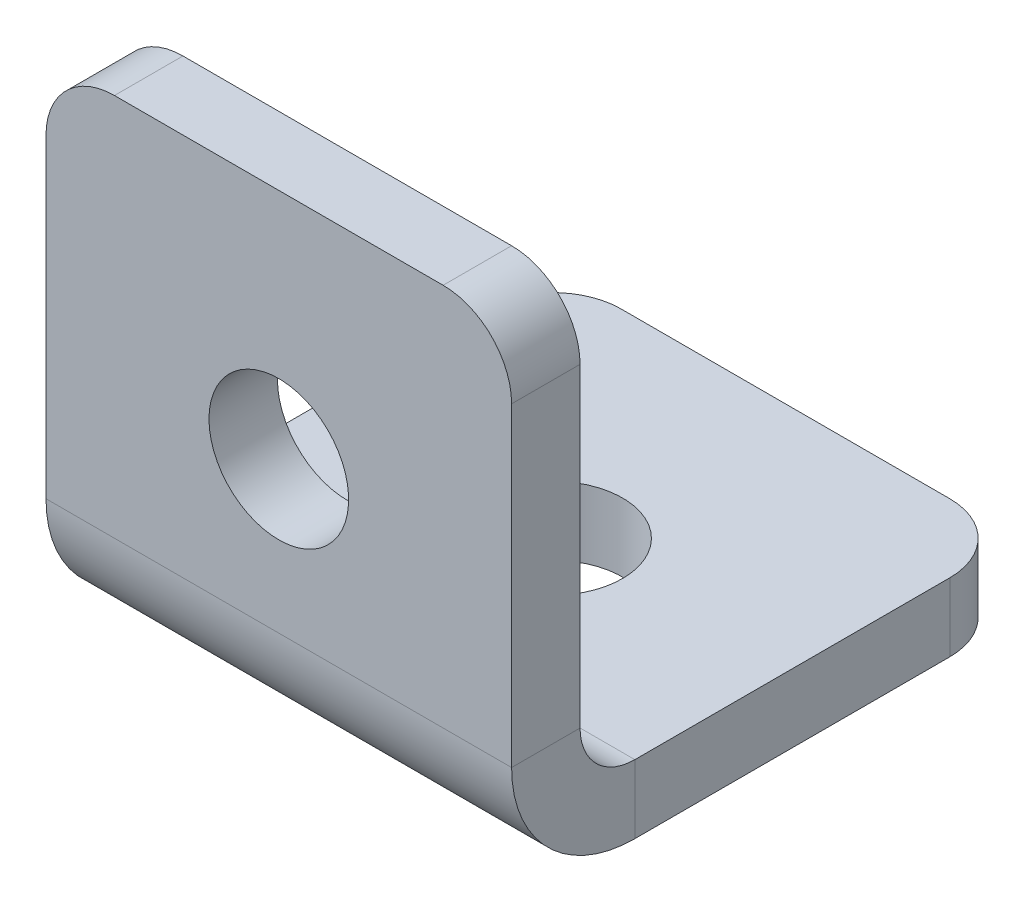
ISO-10303-21;
HEADER;
FILE_DESCRIPTION(('STEP AP214'),'2;1');
FILE_NAME('part.step','',(''),(''),'','','');
FILE_SCHEMA(('AUTOMOTIVE_DESIGN { 1 0 10303 214 1 1 1 1 }'));
ENDSEC;
DATA;
#1=APPLICATION_CONTEXT('core data for automotive mechanical design processes');
#2=APPLICATION_PROTOCOL_DEFINITION('international standard','automotive_design',2000,#1);
#3=PRODUCT_CONTEXT('',#1,'mechanical');
#4=PRODUCT('Part','Part','',(#3));
#5=PRODUCT_RELATED_PRODUCT_CATEGORY('part','',(#4));
#6=PRODUCT_DEFINITION_FORMATION('','',#4);
#7=PRODUCT_DEFINITION_CONTEXT('part definition',#1,'design');
#8=PRODUCT_DEFINITION('design','',#6,#7);
#9=PRODUCT_DEFINITION_SHAPE('','',#8);
#10=(LENGTH_UNIT() NAMED_UNIT(*) SI_UNIT(.MILLI.,.METRE.));
#11=(NAMED_UNIT(*) PLANE_ANGLE_UNIT() SI_UNIT($,.RADIAN.));
#12=(NAMED_UNIT(*) SI_UNIT($,.STERADIAN.) SOLID_ANGLE_UNIT());
#13=UNCERTAINTY_MEASURE_WITH_UNIT(LENGTH_MEASURE(1.E-05),#10,'distance_accuracy_value','');
#14=(GEOMETRIC_REPRESENTATION_CONTEXT(3) GLOBAL_UNCERTAINTY_ASSIGNED_CONTEXT((#13)) GLOBAL_UNIT_ASSIGNED_CONTEXT((#10,
#11,#12)) REPRESENTATION_CONTEXT('',''));
#15=CARTESIAN_POINT('',(0.,0.,0.));
#16=DIRECTION('',(0.,0.,1.));
#17=DIRECTION('',(1.,0.,0.));
#18=AXIS2_PLACEMENT_3D('',#15,#16,#17);
#19=CARTESIAN_POINT('',(17.,4.5,0.));
#20=DIRECTION('',(1.,0.,0.));
#21=DIRECTION('',(0.,0.,-1.));
#22=AXIS2_PLACEMENT_3D('',#19,#20,#21);
#23=PLANE('',#22);
#24=DIRECTION('',(0.,0.,-1.));
#25=VECTOR('',#24,1.);
#26=CARTESIAN_POINT('',(17.,4.5,0.));
#27=LINE('',#26,#25);
#28=CARTESIAN_POINT('',(17.,4.5,0.));
#29=VERTEX_POINT('',#28);
#30=CARTESIAN_POINT('',(17.,4.5,-2.5));
#31=VERTEX_POINT('',#30);
#32=EDGE_CURVE('E115',#29,#31,#27,.T.);
#33=ORIENTED_EDGE('',*,*,#32,.F.);
#34=CARTESIAN_POINT('',(17.,4.5,-4.5));
#35=DIRECTION('',(-1.,0.,0.));
#36=DIRECTION('',(0.,0.,1.));
#37=AXIS2_PLACEMENT_3D('',#34,#35,#36);
#38=CIRCLE('',#37,4.5);
#39=CARTESIAN_POINT('',(17.,0.,-4.5));
#40=VERTEX_POINT('',#39);
#41=EDGE_CURVE('E113',#29,#40,#38,.F.);
#42=ORIENTED_EDGE('',*,*,#41,.T.);
#43=DIRECTION('',(0.,-1.,0.));
#44=VECTOR('',#43,1.);
#45=CARTESIAN_POINT('',(17.,2.5,-4.5));
#46=LINE('',#45,#44);
#47=CARTESIAN_POINT('',(17.,2.5,-4.5));
#48=VERTEX_POINT('',#47);
#49=EDGE_CURVE('E107',#48,#40,#46,.T.);
#50=ORIENTED_EDGE('',*,*,#49,.F.);
#51=CARTESIAN_POINT('',(17.,4.5,-4.5));
#52=DIRECTION('',(1.,0.,0.));
#53=DIRECTION('',(0.,0.,-1.));
#54=AXIS2_PLACEMENT_3D('',#51,#52,#53);
#55=CIRCLE('',#54,2.);
#56=EDGE_CURVE('E111',#31,#48,#55,.T.);
#57=ORIENTED_EDGE('',*,*,#56,.F.);
#58=EDGE_LOOP('',(#33,#42,#50,#57));
#59=FACE_BOUND('',#58,.T.);
#60=ADVANCED_FACE('F16',(#59),#23,.T.);
#61=CARTESIAN_POINT('',(17.,2.5,-4.5));
#62=DIRECTION('',(1.,0.,0.));
#63=DIRECTION('',(0.,0.,-1.));
#64=AXIS2_PLACEMENT_3D('',#61,#62,#63);
#65=PLANE('',#64);
#66=DIRECTION('',(0.,1.,0.));
#67=VECTOR('',#66,1.);
#68=CARTESIAN_POINT('',(17.,0.,-2.5));
#69=LINE('',#68,#67);
#70=CARTESIAN_POINT('',(17.,16.,-2.5));
#71=VERTEX_POINT('',#70);
#72=EDGE_CURVE('E139',#71,#31,#69,.F.);
#73=ORIENTED_EDGE('',*,*,#72,.F.);
#74=DIRECTION('',(0.,0.,-1.));
#75=VECTOR('',#74,1.);
#76=CARTESIAN_POINT('',(17.,16.,-4.5));
#77=LINE('',#76,#75);
#78=CARTESIAN_POINT('',(17.,16.,0.));
#79=VERTEX_POINT('',#78);
#80=EDGE_CURVE('E192',#71,#79,#77,.F.);
#81=ORIENTED_EDGE('',*,*,#80,.T.);
#82=DIRECTION('',(0.,-1.,0.));
#83=VECTOR('',#82,1.);
#84=CARTESIAN_POINT('',(17.,0.,0.));
#85=LINE('',#84,#83);
#86=EDGE_CURVE('E141',#79,#29,#85,.T.);
#87=ORIENTED_EDGE('',*,*,#86,.T.);
#88=ORIENTED_EDGE('',*,*,#32,.T.);
#89=EDGE_LOOP('',(#73,#81,#87,#88));
#90=FACE_BOUND('',#89,.T.);
#91=ADVANCED_FACE('F260',(#90),#65,.T.);
#92=CARTESIAN_POINT('',(0.,0.,-4.5));
#93=DIRECTION('',(-1.,0.,0.));
#94=DIRECTION('',(0.,0.,1.));
#95=AXIS2_PLACEMENT_3D('',#92,#93,#94);
#96=PLANE('',#95);
#97=DIRECTION('',(0.,1.,0.));
#98=VECTOR('',#97,1.);
#99=CARTESIAN_POINT('',(0.,0.,-4.5));
#100=LINE('',#99,#98);
#101=CARTESIAN_POINT('',(0.,0.,-4.5));
#102=VERTEX_POINT('',#101);
#103=CARTESIAN_POINT('',(0.,2.5,-4.5));
#104=VERTEX_POINT('',#103);
#105=EDGE_CURVE('E116',#102,#104,#100,.T.);
#106=ORIENTED_EDGE('',*,*,#105,.F.);
#107=CARTESIAN_POINT('',(0.,4.5,-4.5));
#108=DIRECTION('',(-1.,0.,0.));
#109=DIRECTION('',(0.,0.,1.));
#110=AXIS2_PLACEMENT_3D('',#107,#108,#109);
#111=CIRCLE('',#110,4.5);
#112=CARTESIAN_POINT('',(0.,4.5,0.));
#113=VERTEX_POINT('',#112);
#114=EDGE_CURVE('E159',#113,#102,#111,.F.);
#115=ORIENTED_EDGE('',*,*,#114,.F.);
#116=DIRECTION('',(0.,0.,1.));
#117=VECTOR('',#116,1.);
#118=CARTESIAN_POINT('',(0.,4.5,-2.5));
#119=LINE('',#118,#117);
#120=CARTESIAN_POINT('',(0.,4.5,-2.5));
#121=VERTEX_POINT('',#120);
#122=EDGE_CURVE('E177',#121,#113,#119,.T.);
#123=ORIENTED_EDGE('',*,*,#122,.F.);
#124=CARTESIAN_POINT('',(0.,4.5,-4.5));
#125=DIRECTION('',(1.,0.,0.));
#126=DIRECTION('',(0.,0.,-1.));
#127=AXIS2_PLACEMENT_3D('',#124,#125,#126);
#128=CIRCLE('',#127,2.);
#129=EDGE_CURVE('E153',#121,#104,#128,.T.);
#130=ORIENTED_EDGE('',*,*,#129,.T.);
#131=EDGE_LOOP('',(#106,#115,#123,#130));
#132=FACE_BOUND('',#131,.T.);
#133=ADVANCED_FACE('F265',(#132),#96,.T.);
#134=CARTESIAN_POINT('',(0.,4.5,-2.5));
#135=DIRECTION('',(-1.,0.,0.));
#136=DIRECTION('',(0.,0.,1.));
#137=AXIS2_PLACEMENT_3D('',#134,#135,#136);
#138=PLANE('',#137);
#139=DIRECTION('',(0.,0.,-1.));
#140=VECTOR('',#139,1.);
#141=CARTESIAN_POINT('',(0.,2.5,0.));
#142=LINE('',#141,#140);
#143=CARTESIAN_POINT('',(0.,2.5,-16.));
#144=VERTEX_POINT('',#143);
#145=EDGE_CURVE('E126',#104,#144,#142,.T.);
#146=ORIENTED_EDGE('',*,*,#145,.T.);
#147=DIRECTION('',(0.,-1.,0.));
#148=VECTOR('',#147,1.);
#149=CARTESIAN_POINT('',(0.,4.5,-16.));
#150=LINE('',#149,#148);
#151=CARTESIAN_POINT('',(0.,0.,-16.));
#152=VERTEX_POINT('',#151);
#153=EDGE_CURVE('E201',#144,#152,#150,.T.);
#154=ORIENTED_EDGE('',*,*,#153,.T.);
#155=DIRECTION('',(0.,0.,-1.));
#156=VECTOR('',#155,1.);
#157=CARTESIAN_POINT('',(0.,0.,0.));
#158=LINE('',#157,#156);
#159=EDGE_CURVE('E148',#102,#152,#158,.T.);
#160=ORIENTED_EDGE('',*,*,#159,.F.);
#161=ORIENTED_EDGE('',*,*,#105,.T.);
#162=EDGE_LOOP('',(#146,#154,#160,#161));
#163=FACE_BOUND('',#162,.T.);
#164=ADVANCED_FACE('F217',(#163),#138,.T.);
#165=CARTESIAN_POINT('',(17.,0.,0.));
#166=DIRECTION('',(0.,1.,0.));
#167=DIRECTION('',(0.,0.,1.));
#168=AXIS2_PLACEMENT_3D('',#165,#166,#167);
#169=PLANE('',#168);
#170=CARTESIAN_POINT('',(8.5,0.,-10.));
#171=DIRECTION('',(0.,1.,0.));
#172=DIRECTION('',(0.,0.,1.));
#173=AXIS2_PLACEMENT_3D('',#170,#171,#172);
#174=CIRCLE('',#173,2.55);
#175=CARTESIAN_POINT('',(8.5,0.,-7.45));
#176=VERTEX_POINT('',#175);
#177=EDGE_CURVE('E231',#176,#176,#174,.T.);
#178=ORIENTED_EDGE('',*,*,#177,.T.);
#179=EDGE_LOOP('',(#178));
#180=FACE_BOUND('',#179,.T.);
#181=ORIENTED_EDGE('',*,*,#159,.T.);
#182=CARTESIAN_POINT('',(2.5,0.,-16.));
#183=DIRECTION('',(0.,1.,0.));
#184=DIRECTION('',(0.,0.,1.));
#185=AXIS2_PLACEMENT_3D('',#182,#183,#184);
#186=CIRCLE('',#185,2.5);
#187=CARTESIAN_POINT('',(2.5,0.,-18.5));
#188=VERTEX_POINT('',#187);
#189=EDGE_CURVE('E206',#152,#188,#186,.F.);
#190=ORIENTED_EDGE('',*,*,#189,.T.);
#191=DIRECTION('',(-1.,0.,0.));
#192=VECTOR('',#191,1.);
#193=CARTESIAN_POINT('',(17.,0.,-18.5));
#194=LINE('',#193,#192);
#195=CARTESIAN_POINT('',(14.5,0.,-18.5));
#196=VERTEX_POINT('',#195);
#197=EDGE_CURVE('E175',#196,#188,#194,.T.);
#198=ORIENTED_EDGE('',*,*,#197,.F.);
#199=CARTESIAN_POINT('',(14.5,0.,-16.));
#200=DIRECTION('',(0.,1.,0.));
#201=DIRECTION('',(0.,0.,1.));
#202=AXIS2_PLACEMENT_3D('',#199,#200,#201);
#203=CIRCLE('',#202,2.5);
#204=CARTESIAN_POINT('',(17.,0.,-16.));
#205=VERTEX_POINT('',#204);
#206=EDGE_CURVE('E204',#196,#205,#203,.F.);
#207=ORIENTED_EDGE('',*,*,#206,.T.);
#208=DIRECTION('',(0.,0.,-1.));
#209=VECTOR('',#208,1.);
#210=CARTESIAN_POINT('',(17.,0.,0.));
#211=LINE('',#210,#209);
#212=EDGE_CURVE('E134',#40,#205,#211,.T.);
#213=ORIENTED_EDGE('',*,*,#212,.F.);
#214=DIRECTION('',(-1.,0.,0.));
#215=VECTOR('',#214,1.);
#216=CARTESIAN_POINT('',(17.,0.,-4.5));
#217=LINE('',#216,#215);
#218=EDGE_CURVE('E147',#40,#102,#217,.T.);
#219=ORIENTED_EDGE('',*,*,#218,.T.);
#220=EDGE_LOOP('',(#181,#190,#198,#207,#213,#219));
#221=FACE_BOUND('',#220,.T.);
#222=ADVANCED_FACE('F222',(#180,#221),#169,.F.);
#223=CARTESIAN_POINT('',(17.,2.5,-18.5));
#224=DIRECTION('',(0.,0.,-1.));
#225=DIRECTION('',(-1.,0.,0.));
#226=AXIS2_PLACEMENT_3D('',#223,#224,#225);
#227=PLANE('',#226);
#228=ORIENTED_EDGE('',*,*,#197,.T.);
#229=DIRECTION('',(0.,-1.,0.));
#230=VECTOR('',#229,1.);
#231=CARTESIAN_POINT('',(2.5,2.5,-18.5));
#232=LINE('',#231,#230);
#233=CARTESIAN_POINT('',(2.5,2.5,-18.5));
#234=VERTEX_POINT('',#233);
#235=EDGE_CURVE('E37',#188,#234,#232,.F.);
#236=ORIENTED_EDGE('',*,*,#235,.T.);
#237=DIRECTION('',(-1.,0.,0.));
#238=VECTOR('',#237,1.);
#239=CARTESIAN_POINT('',(17.,2.5,-18.5));
#240=LINE('',#239,#238);
#241=CARTESIAN_POINT('',(14.5,2.5,-18.5));
#242=VERTEX_POINT('',#241);
#243=EDGE_CURVE('E130',#242,#234,#240,.T.);
#244=ORIENTED_EDGE('',*,*,#243,.F.);
#245=DIRECTION('',(0.,-1.,0.));
#246=VECTOR('',#245,1.);
#247=CARTESIAN_POINT('',(14.5,2.5,-18.5));
#248=LINE('',#247,#246);
#249=EDGE_CURVE('E208',#242,#196,#248,.T.);
#250=ORIENTED_EDGE('',*,*,#249,.T.);
#251=EDGE_LOOP('',(#228,#236,#244,#250));
#252=FACE_BOUND('',#251,.T.);
#253=ADVANCED_FACE('F223',(#252),#227,.T.);
#254=CARTESIAN_POINT('',(17.,2.5,0.));
#255=DIRECTION('',(0.,1.,0.));
#256=DIRECTION('',(0.,0.,1.));
#257=AXIS2_PLACEMENT_3D('',#254,#255,#256);
#258=PLANE('',#257);
#259=CARTESIAN_POINT('',(8.5,2.5,-10.));
#260=DIRECTION('',(0.,1.,0.));
#261=DIRECTION('',(0.,0.,1.));
#262=AXIS2_PLACEMENT_3D('',#259,#260,#261);
#263=CIRCLE('',#262,2.55);
#264=CARTESIAN_POINT('',(8.5,2.5,-7.45));
#265=VERTEX_POINT('',#264);
#266=EDGE_CURVE('E234',#265,#265,#263,.T.);
#267=ORIENTED_EDGE('',*,*,#266,.F.);
#268=EDGE_LOOP('',(#267));
#269=FACE_BOUND('',#268,.T.);
#270=ORIENTED_EDGE('',*,*,#243,.T.);
#271=CARTESIAN_POINT('',(2.5,2.5,-16.));
#272=DIRECTION('',(0.,1.,0.));
#273=DIRECTION('',(0.,0.,1.));
#274=AXIS2_PLACEMENT_3D('',#271,#272,#273);
#275=CIRCLE('',#274,2.5);
#276=EDGE_CURVE('E24',#234,#144,#275,.T.);
#277=ORIENTED_EDGE('',*,*,#276,.T.);
#278=ORIENTED_EDGE('',*,*,#145,.F.);
#279=DIRECTION('',(-1.,0.,0.));
#280=VECTOR('',#279,1.);
#281=CARTESIAN_POINT('',(17.,2.5,-4.5));
#282=LINE('',#281,#280);
#283=EDGE_CURVE('E121',#48,#104,#282,.T.);
#284=ORIENTED_EDGE('',*,*,#283,.F.);
#285=DIRECTION('',(0.,0.,-1.));
#286=VECTOR('',#285,1.);
#287=CARTESIAN_POINT('',(17.,2.5,0.));
#288=LINE('',#287,#286);
#289=CARTESIAN_POINT('',(17.,2.5,-16.));
#290=VERTEX_POINT('',#289);
#291=EDGE_CURVE('E123',#48,#290,#288,.T.);
#292=ORIENTED_EDGE('',*,*,#291,.T.);
#293=CARTESIAN_POINT('',(14.5,2.5,-16.));
#294=DIRECTION('',(0.,1.,0.));
#295=DIRECTION('',(0.,0.,1.));
#296=AXIS2_PLACEMENT_3D('',#293,#294,#295);
#297=CIRCLE('',#296,2.5);
#298=EDGE_CURVE('E212',#290,#242,#297,.T.);
#299=ORIENTED_EDGE('',*,*,#298,.T.);
#300=EDGE_LOOP('',(#270,#277,#278,#284,#292,#299));
#301=FACE_BOUND('',#300,.T.);
#302=ADVANCED_FACE('F122',(#269,#301),#258,.T.);
#303=CARTESIAN_POINT('',(17.,4.5,-4.5));
#304=DIRECTION('',(-1.,0.,0.));
#305=DIRECTION('',(0.,0.,1.));
#306=AXIS2_PLACEMENT_3D('',#303,#304,#305);
#307=CYLINDRICAL_SURFACE('',#306,2.);
#308=ORIENTED_EDGE('',*,*,#129,.F.);
#309=DIRECTION('',(-1.,0.,0.));
#310=VECTOR('',#309,1.);
#311=CARTESIAN_POINT('',(17.,4.5,-2.5));
#312=LINE('',#311,#310);
#313=EDGE_CURVE('E131',#31,#121,#312,.T.);
#314=ORIENTED_EDGE('',*,*,#313,.F.);
#315=ORIENTED_EDGE('',*,*,#56,.T.);
#316=ORIENTED_EDGE('',*,*,#283,.T.);
#317=EDGE_LOOP('',(#308,#314,#315,#316));
#318=FACE_BOUND('',#317,.T.);
#319=ADVANCED_FACE('F137',(#318),#307,.F.);
#320=CARTESIAN_POINT('',(17.,0.,-2.5));
#321=DIRECTION('',(0.,0.,-1.));
#322=DIRECTION('',(-1.,0.,0.));
#323=AXIS2_PLACEMENT_3D('',#320,#321,#322);
#324=PLANE('',#323);
#325=CARTESIAN_POINT('',(8.5,10.,-2.5));
#326=DIRECTION('',(0.,0.,-1.));
#327=DIRECTION('',(-1.,0.,0.));
#328=AXIS2_PLACEMENT_3D('',#325,#326,#327);
#329=CIRCLE('',#328,2.55);
#330=CARTESIAN_POINT('',(5.95,10.,-2.5));
#331=VERTEX_POINT('',#330);
#332=EDGE_CURVE('E228',#331,#331,#329,.T.);
#333=ORIENTED_EDGE('',*,*,#332,.F.);
#334=EDGE_LOOP('',(#333));
#335=FACE_BOUND('',#334,.T.);
#336=DIRECTION('',(-1.,0.,0.));
#337=VECTOR('',#336,1.);
#338=CARTESIAN_POINT('',(17.,18.5,-2.5));
#339=LINE('',#338,#337);
#340=CARTESIAN_POINT('',(14.5,18.5,-2.5));
#341=VERTEX_POINT('',#340);
#342=CARTESIAN_POINT('',(2.5,18.5,-2.5));
#343=VERTEX_POINT('',#342);
#344=EDGE_CURVE('E170',#341,#343,#339,.T.);
#345=ORIENTED_EDGE('',*,*,#344,.F.);
#346=CARTESIAN_POINT('',(14.5,16.,-2.5));
#347=DIRECTION('',(0.,0.,-1.));
#348=DIRECTION('',(-1.,0.,0.));
#349=AXIS2_PLACEMENT_3D('',#346,#347,#348);
#350=CIRCLE('',#349,2.5);
#351=EDGE_CURVE('E190',#341,#71,#350,.T.);
#352=ORIENTED_EDGE('',*,*,#351,.T.);
#353=ORIENTED_EDGE('',*,*,#72,.T.);
#354=ORIENTED_EDGE('',*,*,#313,.T.);
#355=DIRECTION('',(0.,1.,0.));
#356=VECTOR('',#355,1.);
#357=CARTESIAN_POINT('',(0.,0.,-2.5));
#358=LINE('',#357,#356);
#359=CARTESIAN_POINT('',(0.,16.,-2.5));
#360=VERTEX_POINT('',#359);
#361=EDGE_CURVE('E155',#360,#121,#358,.F.);
#362=ORIENTED_EDGE('',*,*,#361,.F.);
#363=CARTESIAN_POINT('',(2.5,16.,-2.5));
#364=DIRECTION('',(0.,0.,-1.));
#365=DIRECTION('',(-1.,0.,0.));
#366=AXIS2_PLACEMENT_3D('',#363,#364,#365);
#367=CIRCLE('',#366,2.5);
#368=EDGE_CURVE('E188',#360,#343,#367,.T.);
#369=ORIENTED_EDGE('',*,*,#368,.T.);
#370=EDGE_LOOP('',(#345,#352,#353,#354,#362,#369));
#371=FACE_BOUND('',#370,.T.);
#372=ADVANCED_FACE('F256',(#335,#371),#324,.T.);
#373=CARTESIAN_POINT('',(17.,18.5,0.));
#374=DIRECTION('',(0.,1.,0.));
#375=DIRECTION('',(0.,0.,1.));
#376=AXIS2_PLACEMENT_3D('',#373,#374,#375);
#377=PLANE('',#376);
#378=DIRECTION('',(-1.,0.,0.));
#379=VECTOR('',#378,1.);
#380=CARTESIAN_POINT('',(17.,18.5,0.));
#381=LINE('',#380,#379);
#382=CARTESIAN_POINT('',(14.5,18.5,0.));
#383=VERTEX_POINT('',#382);
#384=CARTESIAN_POINT('',(2.5,18.5,0.));
#385=VERTEX_POINT('',#384);
#386=EDGE_CURVE('E167',#383,#385,#381,.T.);
#387=ORIENTED_EDGE('',*,*,#386,.F.);
#388=DIRECTION('',(0.,0.,-1.));
#389=VECTOR('',#388,1.);
#390=CARTESIAN_POINT('',(14.5,18.5,0.));
#391=LINE('',#390,#389);
#392=EDGE_CURVE('E185',#383,#341,#391,.T.);
#393=ORIENTED_EDGE('',*,*,#392,.T.);
#394=ORIENTED_EDGE('',*,*,#344,.T.);
#395=DIRECTION('',(0.,0.,-1.));
#396=VECTOR('',#395,1.);
#397=CARTESIAN_POINT('',(2.5,18.5,0.));
#398=LINE('',#397,#396);
#399=EDGE_CURVE('E183',#343,#385,#398,.F.);
#400=ORIENTED_EDGE('',*,*,#399,.T.);
#401=EDGE_LOOP('',(#387,#393,#394,#400));
#402=FACE_BOUND('',#401,.T.);
#403=ADVANCED_FACE('F359',(#402),#377,.T.);
#404=CARTESIAN_POINT('',(17.,0.,0.));
#405=DIRECTION('',(0.,0.,-1.));
#406=DIRECTION('',(-1.,0.,0.));
#407=AXIS2_PLACEMENT_3D('',#404,#405,#406);
#408=PLANE('',#407);
#409=CARTESIAN_POINT('',(8.5,10.,0.));
#410=DIRECTION('',(0.,0.,-1.));
#411=DIRECTION('',(-1.,0.,0.));
#412=AXIS2_PLACEMENT_3D('',#409,#410,#411);
#413=CIRCLE('',#412,2.55);
#414=CARTESIAN_POINT('',(5.95,10.,0.));
#415=VERTEX_POINT('',#414);
#416=EDGE_CURVE('E151',#415,#415,#413,.T.);
#417=ORIENTED_EDGE('',*,*,#416,.T.);
#418=EDGE_LOOP('',(#417));
#419=FACE_BOUND('',#418,.T.);
#420=ORIENTED_EDGE('',*,*,#86,.F.);
#421=CARTESIAN_POINT('',(14.5,16.,0.));
#422=DIRECTION('',(0.,0.,-1.));
#423=DIRECTION('',(-1.,0.,0.));
#424=AXIS2_PLACEMENT_3D('',#421,#422,#423);
#425=CIRCLE('',#424,2.5);
#426=EDGE_CURVE('E196',#79,#383,#425,.F.);
#427=ORIENTED_EDGE('',*,*,#426,.T.);
#428=ORIENTED_EDGE('',*,*,#386,.T.);
#429=CARTESIAN_POINT('',(2.5,16.,0.));
#430=DIRECTION('',(0.,0.,-1.));
#431=DIRECTION('',(-1.,0.,0.));
#432=AXIS2_PLACEMENT_3D('',#429,#430,#431);
#433=CIRCLE('',#432,2.5);
#434=CARTESIAN_POINT('',(0.,16.,0.));
#435=VERTEX_POINT('',#434);
#436=EDGE_CURVE('E194',#385,#435,#433,.F.);
#437=ORIENTED_EDGE('',*,*,#436,.T.);
#438=DIRECTION('',(0.,-1.,0.));
#439=VECTOR('',#438,1.);
#440=CARTESIAN_POINT('',(0.,0.,0.));
#441=LINE('',#440,#439);
#442=EDGE_CURVE('E157',#435,#113,#441,.T.);
#443=ORIENTED_EDGE('',*,*,#442,.T.);
#444=DIRECTION('',(-1.,0.,0.));
#445=VECTOR('',#444,1.);
#446=CARTESIAN_POINT('',(17.,4.5,0.));
#447=LINE('',#446,#445);
#448=EDGE_CURVE('E164',#29,#113,#447,.T.);
#449=ORIENTED_EDGE('',*,*,#448,.F.);
#450=EDGE_LOOP('',(#420,#427,#428,#437,#443,#449));
#451=FACE_BOUND('',#450,.T.);
#452=ADVANCED_FACE('F349',(#419,#451),#408,.F.);
#453=CARTESIAN_POINT('',(17.,4.5,-4.5));
#454=DIRECTION('',(-1.,0.,0.));
#455=DIRECTION('',(0.,0.,1.));
#456=AXIS2_PLACEMENT_3D('',#453,#454,#455);
#457=CYLINDRICAL_SURFACE('',#456,4.5);
#458=ORIENTED_EDGE('',*,*,#114,.T.);
#459=ORIENTED_EDGE('',*,*,#218,.F.);
#460=ORIENTED_EDGE('',*,*,#41,.F.);
#461=ORIENTED_EDGE('',*,*,#448,.T.);
#462=EDGE_LOOP('',(#458,#459,#460,#461));
#463=FACE_BOUND('',#462,.T.);
#464=ADVANCED_FACE('F340',(#463),#457,.T.);
#465=CARTESIAN_POINT('',(17.,4.5,-4.5));
#466=DIRECTION('',(1.,0.,0.));
#467=DIRECTION('',(0.,0.,-1.));
#468=AXIS2_PLACEMENT_3D('',#465,#466,#467);
#469=PLANE('',#468);
#470=ORIENTED_EDGE('',*,*,#212,.T.);
#471=DIRECTION('',(0.,-1.,0.));
#472=VECTOR('',#471,1.);
#473=CARTESIAN_POINT('',(17.,4.5,-16.));
#474=LINE('',#473,#472);
#475=EDGE_CURVE('E10',#205,#290,#474,.F.);
#476=ORIENTED_EDGE('',*,*,#475,.T.);
#477=ORIENTED_EDGE('',*,*,#291,.F.);
#478=ORIENTED_EDGE('',*,*,#49,.T.);
#479=EDGE_LOOP('',(#470,#476,#477,#478));
#480=FACE_BOUND('',#479,.T.);
#481=ADVANCED_FACE('F133',(#480),#469,.T.);
#482=CARTESIAN_POINT('',(0.,4.5,-4.5));
#483=DIRECTION('',(1.,0.,0.));
#484=DIRECTION('',(0.,0.,-1.));
#485=AXIS2_PLACEMENT_3D('',#482,#483,#484);
#486=PLANE('',#485);
#487=ORIENTED_EDGE('',*,*,#442,.F.);
#488=DIRECTION('',(0.,0.,-1.));
#489=VECTOR('',#488,1.);
#490=CARTESIAN_POINT('',(0.,16.,-2.5));
#491=LINE('',#490,#489);
#492=EDGE_CURVE('E198',#435,#360,#491,.T.);
#493=ORIENTED_EDGE('',*,*,#492,.T.);
#494=ORIENTED_EDGE('',*,*,#361,.T.);
#495=ORIENTED_EDGE('',*,*,#122,.T.);
#496=EDGE_LOOP('',(#487,#493,#494,#495));
#497=FACE_BOUND('',#496,.T.);
#498=ADVANCED_FACE('F321',(#497),#486,.F.);
#499=CARTESIAN_POINT('',(8.5,10.,0.));
#500=DIRECTION('',(0.,0.,-1.));
#501=DIRECTION('',(-1.,0.,0.));
#502=AXIS2_PLACEMENT_3D('',#499,#500,#501);
#503=CYLINDRICAL_SURFACE('',#502,2.55);
#504=ORIENTED_EDGE('',*,*,#416,.F.);
#505=EDGE_LOOP('',(#504));
#506=FACE_BOUND('',#505,.T.);
#507=ORIENTED_EDGE('',*,*,#332,.T.);
#508=EDGE_LOOP('',(#507));
#509=FACE_BOUND('',#508,.T.);
#510=ADVANCED_FACE('F245',(#506,#509),#503,.F.);
#511=CARTESIAN_POINT('',(8.5,0.,-10.));
#512=DIRECTION('',(0.,1.,0.));
#513=DIRECTION('',(0.,0.,1.));
#514=AXIS2_PLACEMENT_3D('',#511,#512,#513);
#515=CYLINDRICAL_SURFACE('',#514,2.55);
#516=ORIENTED_EDGE('',*,*,#177,.F.);
#517=EDGE_LOOP('',(#516));
#518=FACE_BOUND('',#517,.T.);
#519=ORIENTED_EDGE('',*,*,#266,.T.);
#520=EDGE_LOOP('',(#519));
#521=FACE_BOUND('',#520,.T.);
#522=ADVANCED_FACE('F241',(#518,#521),#515,.F.);
#523=CARTESIAN_POINT('',(14.5,16.,0.));
#524=DIRECTION('',(0.,0.,-1.));
#525=DIRECTION('',(-1.,0.,0.));
#526=AXIS2_PLACEMENT_3D('',#523,#524,#525);
#527=CYLINDRICAL_SURFACE('',#526,2.5);
#528=ORIENTED_EDGE('',*,*,#426,.F.);
#529=ORIENTED_EDGE('',*,*,#80,.F.);
#530=ORIENTED_EDGE('',*,*,#351,.F.);
#531=ORIENTED_EDGE('',*,*,#392,.F.);
#532=EDGE_LOOP('',(#528,#529,#530,#531));
#533=FACE_BOUND('',#532,.T.);
#534=ADVANCED_FACE('F244',(#533),#527,.T.);
#535=CARTESIAN_POINT('',(2.5,16.,-4.5));
#536=DIRECTION('',(0.,0.,1.));
#537=DIRECTION('',(1.,0.,0.));
#538=AXIS2_PLACEMENT_3D('',#535,#536,#537);
#539=CYLINDRICAL_SURFACE('',#538,2.5);
#540=ORIENTED_EDGE('',*,*,#436,.F.);
#541=ORIENTED_EDGE('',*,*,#399,.F.);
#542=ORIENTED_EDGE('',*,*,#368,.F.);
#543=ORIENTED_EDGE('',*,*,#492,.F.);
#544=EDGE_LOOP('',(#540,#541,#542,#543));
#545=FACE_BOUND('',#544,.T.);
#546=ADVANCED_FACE('F272',(#545),#539,.T.);
#547=CARTESIAN_POINT('',(2.5,4.5,-16.));
#548=DIRECTION('',(0.,-1.,0.));
#549=DIRECTION('',(0.,0.,-1.));
#550=AXIS2_PLACEMENT_3D('',#547,#548,#549);
#551=CYLINDRICAL_SURFACE('',#550,2.5);
#552=ORIENTED_EDGE('',*,*,#276,.F.);
#553=ORIENTED_EDGE('',*,*,#235,.F.);
#554=ORIENTED_EDGE('',*,*,#189,.F.);
#555=ORIENTED_EDGE('',*,*,#153,.F.);
#556=EDGE_LOOP('',(#552,#553,#554,#555));
#557=FACE_BOUND('',#556,.T.);
#558=ADVANCED_FACE('F219',(#557),#551,.T.);
#559=CARTESIAN_POINT('',(14.5,2.5,-16.));
#560=DIRECTION('',(0.,-1.,0.));
#561=DIRECTION('',(0.,0.,-1.));
#562=AXIS2_PLACEMENT_3D('',#559,#560,#561);
#563=CYLINDRICAL_SURFACE('',#562,2.5);
#564=ORIENTED_EDGE('',*,*,#298,.F.);
#565=ORIENTED_EDGE('',*,*,#475,.F.);
#566=ORIENTED_EDGE('',*,*,#206,.F.);
#567=ORIENTED_EDGE('',*,*,#249,.F.);
#568=EDGE_LOOP('',(#564,#565,#566,#567));
#569=FACE_BOUND('',#568,.T.);
#570=ADVANCED_FACE('F18',(#569),#563,.T.);
#571=CLOSED_SHELL('',(#60,#91,#133,#164,#222,#253,#302,#319,#372,#403,#452,#464,#481,#498,#510,
#522,#534,#546,#558,#570));
#572=MANIFOLD_SOLID_BREP('B1',#571);
#573=ADVANCED_BREP_SHAPE_REPRESENTATION('',(#18,#572),#14);
#574=SHAPE_DEFINITION_REPRESENTATION(#9,#573);
ENDSEC;
END-ISO-10303-21;
